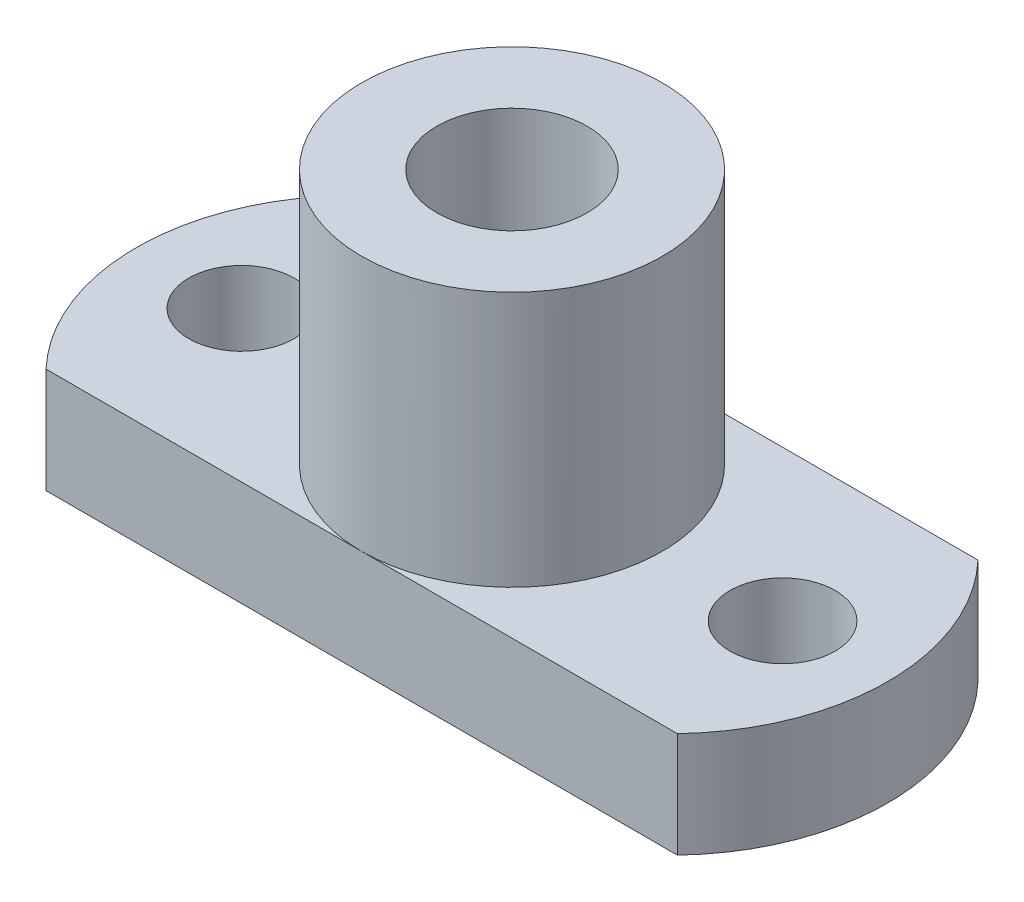
ISO-10303-21;
HEADER;
FILE_DESCRIPTION(('STEP AP214'),'2;1');
FILE_NAME('part.step','',(''),(''),'','','');
FILE_SCHEMA(('AUTOMOTIVE_DESIGN { 1 0 10303 214 1 1 1 1 }'));
ENDSEC;
DATA;
#1=APPLICATION_CONTEXT('core data for automotive mechanical design processes');
#2=APPLICATION_PROTOCOL_DEFINITION('international standard','automotive_design',2000,#1);
#3=PRODUCT_CONTEXT('',#1,'mechanical');
#4=PRODUCT('Part','Part','',(#3));
#5=PRODUCT_RELATED_PRODUCT_CATEGORY('part','',(#4));
#6=PRODUCT_DEFINITION_FORMATION('','',#4);
#7=PRODUCT_DEFINITION_CONTEXT('part definition',#1,'design');
#8=PRODUCT_DEFINITION('design','',#6,#7);
#9=PRODUCT_DEFINITION_SHAPE('','',#8);
#10=(LENGTH_UNIT() NAMED_UNIT(*) SI_UNIT(.MILLI.,.METRE.));
#11=(NAMED_UNIT(*) PLANE_ANGLE_UNIT() SI_UNIT($,.RADIAN.));
#12=(NAMED_UNIT(*) SI_UNIT($,.STERADIAN.) SOLID_ANGLE_UNIT());
#13=UNCERTAINTY_MEASURE_WITH_UNIT(LENGTH_MEASURE(1.E-05),#10,'distance_accuracy_value','');
#14=(GEOMETRIC_REPRESENTATION_CONTEXT(3) GLOBAL_UNCERTAINTY_ASSIGNED_CONTEXT((#13)) GLOBAL_UNIT_ASSIGNED_CONTEXT((#10,
#11,#12)) REPRESENTATION_CONTEXT('',''));
#15=CARTESIAN_POINT('',(0.,0.,0.));
#16=DIRECTION('',(0.,0.,1.));
#17=DIRECTION('',(1.,0.,0.));
#18=AXIS2_PLACEMENT_3D('',#15,#16,#17);
#19=CARTESIAN_POINT('',(0.,12.,0.));
#20=DIRECTION('',(0.,-1.,0.));
#21=DIRECTION('',(0.,0.,-1.));
#22=AXIS2_PLACEMENT_3D('',#19,#20,#21);
#23=CYLINDRICAL_SURFACE('',#22,5.);
#24=CARTESIAN_POINT('',(0.,12.,0.));
#25=DIRECTION('',(0.,1.,0.));
#26=DIRECTION('',(0.,0.,1.));
#27=AXIS2_PLACEMENT_3D('',#24,#25,#26);
#28=CIRCLE('',#27,5.);
#29=CARTESIAN_POINT('',(0.,12.,5.));
#30=VERTEX_POINT('',#29);
#31=EDGE_CURVE('E11',#30,#30,#28,.T.);
#32=ORIENTED_EDGE('',*,*,#31,.F.);
#33=EDGE_LOOP('',(#32));
#34=FACE_BOUND('',#33,.T.);
#35=CARTESIAN_POINT('',(0.,3.5,0.));
#36=DIRECTION('',(0.,-1.,0.));
#37=DIRECTION('',(0.,0.,1.));
#38=AXIS2_PLACEMENT_3D('',#35,#36,#37);
#39=CIRCLE('',#38,5.);
#40=CARTESIAN_POINT('',(0.,3.5,5.));
#41=VERTEX_POINT('',#40);
#42=CARTESIAN_POINT('',(0.,3.5,-5.));
#43=VERTEX_POINT('',#42);
#44=EDGE_CURVE('E92',#41,#43,#39,.T.);
#45=ORIENTED_EDGE('',*,*,#44,.F.);
#46=CARTESIAN_POINT('',(0.,3.5,0.));
#47=DIRECTION('',(0.,1.,0.));
#48=DIRECTION('',(0.,0.,1.));
#49=AXIS2_PLACEMENT_3D('',#46,#47,#48);
#50=CIRCLE('',#49,5.);
#51=EDGE_CURVE('E145',#41,#43,#50,.T.);
#52=ORIENTED_EDGE('',*,*,#51,.T.);
#53=EDGE_LOOP('',(#45,#52));
#54=FACE_BOUND('',#53,.T.);
#55=ADVANCED_FACE('F35',(#34,#54),#23,.T.);
#56=CARTESIAN_POINT('',(0.,12.,0.));
#57=DIRECTION('',(0.,1.,0.));
#58=DIRECTION('',(0.,0.,1.));
#59=AXIS2_PLACEMENT_3D('',#56,#57,#58);
#60=PLANE('',#59);
#61=ORIENTED_EDGE('',*,*,#31,.T.);
#62=EDGE_LOOP('',(#61));
#63=FACE_BOUND('',#62,.T.);
#64=CARTESIAN_POINT('',(0.,12.,0.));
#65=DIRECTION('',(0.,1.,0.));
#66=DIRECTION('',(0.,0.,1.));
#67=AXIS2_PLACEMENT_3D('',#64,#65,#66);
#68=CIRCLE('',#67,2.5);
#69=CARTESIAN_POINT('',(0.,12.,2.5));
#70=VERTEX_POINT('',#69);
#71=EDGE_CURVE('E43',#70,#70,#68,.T.);
#72=ORIENTED_EDGE('',*,*,#71,.F.);
#73=EDGE_LOOP('',(#72));
#74=FACE_BOUND('',#73,.T.);
#75=ADVANCED_FACE('F132',(#63,#74),#60,.T.);
#76=CARTESIAN_POINT('',(0.,0.,0.));
#77=DIRECTION('',(0.,1.,0.));
#78=DIRECTION('',(0.,0.,1.));
#79=AXIS2_PLACEMENT_3D('',#76,#77,#78);
#80=PLANE('',#79);
#81=DIRECTION('',(-1.,0.,0.));
#82=VECTOR('',#81,1.);
#83=CARTESIAN_POINT('',(-10.5,0.,-5.));
#84=LINE('',#83,#82);
#85=CARTESIAN_POINT('',(10.5,0.,-5.));
#86=VERTEX_POINT('',#85);
#87=CARTESIAN_POINT('',(-10.5,0.,-5.));
#88=VERTEX_POINT('',#87);
#89=EDGE_CURVE('E63',#86,#88,#84,.T.);
#90=ORIENTED_EDGE('',*,*,#89,.F.);
#91=CARTESIAN_POINT('',(5.25000000000001,0.,0.));
#92=DIRECTION('',(0.,-1.,0.));
#93=DIRECTION('',(0.,0.,-1.));
#94=AXIS2_PLACEMENT_3D('',#91,#92,#93);
#95=CIRCLE('',#94,7.25);
#96=CARTESIAN_POINT('',(10.5,0.,5.));
#97=VERTEX_POINT('',#96);
#98=EDGE_CURVE('E152',#86,#97,#95,.T.);
#99=ORIENTED_EDGE('',*,*,#98,.T.);
#100=DIRECTION('',(1.,0.,0.));
#101=VECTOR('',#100,1.);
#102=CARTESIAN_POINT('',(0.,0.,5.));
#103=LINE('',#102,#101);
#104=CARTESIAN_POINT('',(-10.5,0.,5.));
#105=VERTEX_POINT('',#104);
#106=EDGE_CURVE('E113',#105,#97,#103,.T.);
#107=ORIENTED_EDGE('',*,*,#106,.F.);
#108=CARTESIAN_POINT('',(-5.25000000000001,0.,0.));
#109=DIRECTION('',(0.,1.,0.));
#110=DIRECTION('',(0.,0.,-1.));
#111=AXIS2_PLACEMENT_3D('',#108,#109,#110);
#112=CIRCLE('',#111,7.25);
#113=EDGE_CURVE('E110',#88,#105,#112,.T.);
#114=ORIENTED_EDGE('',*,*,#113,.F.);
#115=EDGE_LOOP('',(#90,#99,#107,#114));
#116=FACE_BOUND('',#115,.T.);
#117=CARTESIAN_POINT('',(0.,0.,0.));
#118=DIRECTION('',(0.,1.,0.));
#119=DIRECTION('',(0.,0.,1.));
#120=AXIS2_PLACEMENT_3D('',#117,#118,#119);
#121=CIRCLE('',#120,2.5);
#122=CARTESIAN_POINT('',(0.,0.,2.5));
#123=VERTEX_POINT('',#122);
#124=EDGE_CURVE('E100',#123,#123,#121,.T.);
#125=ORIENTED_EDGE('',*,*,#124,.T.);
#126=EDGE_LOOP('',(#125));
#127=FACE_BOUND('',#126,.T.);
#128=CARTESIAN_POINT('',(-9.,0.,0.));
#129=DIRECTION('',(0.,1.,0.));
#130=DIRECTION('',(0.,0.,1.));
#131=AXIS2_PLACEMENT_3D('',#128,#129,#130);
#132=CIRCLE('',#131,1.75);
#133=CARTESIAN_POINT('',(-9.,0.,1.75));
#134=VERTEX_POINT('',#133);
#135=EDGE_CURVE('E169',#134,#134,#132,.T.);
#136=ORIENTED_EDGE('',*,*,#135,.T.);
#137=EDGE_LOOP('',(#136));
#138=FACE_BOUND('',#137,.T.);
#139=CARTESIAN_POINT('',(9.,0.,0.));
#140=DIRECTION('',(0.,-1.,0.));
#141=DIRECTION('',(0.,0.,1.));
#142=AXIS2_PLACEMENT_3D('',#139,#140,#141);
#143=CIRCLE('',#142,1.75);
#144=CARTESIAN_POINT('',(9.,0.,1.75));
#145=VERTEX_POINT('',#144);
#146=EDGE_CURVE('E237',#145,#145,#143,.T.);
#147=ORIENTED_EDGE('',*,*,#146,.F.);
#148=EDGE_LOOP('',(#147));
#149=FACE_BOUND('',#148,.T.);
#150=ADVANCED_FACE('F120',(#116,#127,#138,#149),#80,.F.);
#151=CARTESIAN_POINT('',(0.,12.,0.));
#152=DIRECTION('',(0.,-1.,0.));
#153=DIRECTION('',(0.,0.,-1.));
#154=AXIS2_PLACEMENT_3D('',#151,#152,#153);
#155=CYLINDRICAL_SURFACE('',#154,2.5);
#156=ORIENTED_EDGE('',*,*,#71,.T.);
#157=EDGE_LOOP('',(#156));
#158=FACE_BOUND('',#157,.T.);
#159=ORIENTED_EDGE('',*,*,#124,.F.);
#160=EDGE_LOOP('',(#159));
#161=FACE_BOUND('',#160,.T.);
#162=ADVANCED_FACE('F123',(#158,#161),#155,.F.);
#163=CARTESIAN_POINT('',(0.,3.5,0.));
#164=DIRECTION('',(0.,1.,0.));
#165=DIRECTION('',(0.,0.,1.));
#166=AXIS2_PLACEMENT_3D('',#163,#164,#165);
#167=PLANE('',#166);
#168=ORIENTED_EDGE('',*,*,#44,.T.);
#169=DIRECTION('',(-1.,0.,0.));
#170=VECTOR('',#169,1.);
#171=CARTESIAN_POINT('',(-10.5,3.5,-5.));
#172=LINE('',#171,#170);
#173=CARTESIAN_POINT('',(-10.5,3.5,-5.));
#174=VERTEX_POINT('',#173);
#175=EDGE_CURVE('E86',#43,#174,#172,.T.);
#176=ORIENTED_EDGE('',*,*,#175,.T.);
#177=CARTESIAN_POINT('',(-5.25000000000001,3.5,0.));
#178=DIRECTION('',(0.,1.,0.));
#179=DIRECTION('',(0.,0.,-1.));
#180=AXIS2_PLACEMENT_3D('',#177,#178,#179);
#181=CIRCLE('',#180,7.25);
#182=CARTESIAN_POINT('',(-10.5,3.5,5.));
#183=VERTEX_POINT('',#182);
#184=EDGE_CURVE('E90',#174,#183,#181,.T.);
#185=ORIENTED_EDGE('',*,*,#184,.T.);
#186=DIRECTION('',(1.,0.,0.));
#187=VECTOR('',#186,1.);
#188=CARTESIAN_POINT('',(0.,3.5,5.));
#189=LINE('',#188,#187);
#190=EDGE_CURVE('E51',#183,#41,#189,.T.);
#191=ORIENTED_EDGE('',*,*,#190,.T.);
#192=EDGE_LOOP('',(#168,#176,#185,#191));
#193=FACE_BOUND('',#192,.T.);
#194=CARTESIAN_POINT('',(-9.,3.5,0.));
#195=DIRECTION('',(0.,1.,0.));
#196=DIRECTION('',(0.,0.,1.));
#197=AXIS2_PLACEMENT_3D('',#194,#195,#196);
#198=CIRCLE('',#197,1.75);
#199=CARTESIAN_POINT('',(-9.,3.5,1.75));
#200=VERTEX_POINT('',#199);
#201=EDGE_CURVE('E111',#200,#200,#198,.T.);
#202=ORIENTED_EDGE('',*,*,#201,.F.);
#203=EDGE_LOOP('',(#202));
#204=FACE_BOUND('',#203,.T.);
#205=ADVANCED_FACE('F87',(#193,#204),#167,.T.);
#206=CARTESIAN_POINT('',(-10.5,3.5,-5.));
#207=DIRECTION('',(0.,0.,1.));
#208=DIRECTION('',(1.,0.,0.));
#209=AXIS2_PLACEMENT_3D('',#206,#207,#208);
#210=PLANE('',#209);
#211=ORIENTED_EDGE('',*,*,#89,.T.);
#212=DIRECTION('',(0.,-1.,0.));
#213=VECTOR('',#212,1.);
#214=CARTESIAN_POINT('',(-10.5,3.5,-5.));
#215=LINE('',#214,#213);
#216=EDGE_CURVE('E96',#174,#88,#215,.T.);
#217=ORIENTED_EDGE('',*,*,#216,.F.);
#218=ORIENTED_EDGE('',*,*,#175,.F.);
#219=DIRECTION('',(1.,0.,0.));
#220=VECTOR('',#219,1.);
#221=CARTESIAN_POINT('',(10.5,3.5,-5.));
#222=LINE('',#221,#220);
#223=CARTESIAN_POINT('',(10.5,3.5,-5.));
#224=VERTEX_POINT('',#223);
#225=EDGE_CURVE('E151',#43,#224,#222,.T.);
#226=ORIENTED_EDGE('',*,*,#225,.T.);
#227=DIRECTION('',(0.,-1.,0.));
#228=VECTOR('',#227,1.);
#229=CARTESIAN_POINT('',(10.5,3.5,-5.));
#230=LINE('',#229,#228);
#231=EDGE_CURVE('E73',#224,#86,#230,.T.);
#232=ORIENTED_EDGE('',*,*,#231,.T.);
#233=EDGE_LOOP('',(#211,#217,#218,#226,#232));
#234=FACE_BOUND('',#233,.T.);
#235=ADVANCED_FACE('F97',(#234),#210,.F.);
#236=CARTESIAN_POINT('',(-5.25000000000001,3.5,0.));
#237=DIRECTION('',(0.,-1.,0.));
#238=DIRECTION('',(0.,0.,-1.));
#239=AXIS2_PLACEMENT_3D('',#236,#237,#238);
#240=CYLINDRICAL_SURFACE('',#239,7.25);
#241=ORIENTED_EDGE('',*,*,#113,.T.);
#242=DIRECTION('',(0.,-1.,0.));
#243=VECTOR('',#242,1.);
#244=CARTESIAN_POINT('',(-10.5,3.5,5.));
#245=LINE('',#244,#243);
#246=EDGE_CURVE('E101',#183,#105,#245,.T.);
#247=ORIENTED_EDGE('',*,*,#246,.F.);
#248=ORIENTED_EDGE('',*,*,#184,.F.);
#249=ORIENTED_EDGE('',*,*,#216,.T.);
#250=EDGE_LOOP('',(#241,#247,#248,#249));
#251=FACE_BOUND('',#250,.T.);
#252=ADVANCED_FACE('F103',(#251),#240,.T.);
#253=CARTESIAN_POINT('',(0.,3.5,5.));
#254=DIRECTION('',(0.,0.,-1.));
#255=DIRECTION('',(-1.,0.,0.));
#256=AXIS2_PLACEMENT_3D('',#253,#254,#255);
#257=PLANE('',#256);
#258=ORIENTED_EDGE('',*,*,#106,.T.);
#259=DIRECTION('',(0.,-1.,0.));
#260=VECTOR('',#259,1.);
#261=CARTESIAN_POINT('',(10.5,3.5,5.));
#262=LINE('',#261,#260);
#263=CARTESIAN_POINT('',(10.5,3.5,5.));
#264=VERTEX_POINT('',#263);
#265=EDGE_CURVE('E157',#264,#97,#262,.T.);
#266=ORIENTED_EDGE('',*,*,#265,.F.);
#267=DIRECTION('',(-1.,0.,0.));
#268=VECTOR('',#267,1.);
#269=CARTESIAN_POINT('',(0.,3.5,5.));
#270=LINE('',#269,#268);
#271=EDGE_CURVE('E150',#264,#41,#270,.T.);
#272=ORIENTED_EDGE('',*,*,#271,.T.);
#273=ORIENTED_EDGE('',*,*,#190,.F.);
#274=ORIENTED_EDGE('',*,*,#246,.T.);
#275=EDGE_LOOP('',(#258,#266,#272,#273,#274));
#276=FACE_BOUND('',#275,.T.);
#277=ADVANCED_FACE('F155',(#276),#257,.F.);
#278=CARTESIAN_POINT('',(-9.,3.5,0.));
#279=DIRECTION('',(0.,-1.,0.));
#280=DIRECTION('',(0.,0.,-1.));
#281=AXIS2_PLACEMENT_3D('',#278,#279,#280);
#282=CYLINDRICAL_SURFACE('',#281,1.75);
#283=ORIENTED_EDGE('',*,*,#201,.T.);
#284=EDGE_LOOP('',(#283));
#285=FACE_BOUND('',#284,.T.);
#286=ORIENTED_EDGE('',*,*,#135,.F.);
#287=EDGE_LOOP('',(#286));
#288=FACE_BOUND('',#287,.T.);
#289=ADVANCED_FACE('F176',(#285,#288),#282,.F.);
#290=CARTESIAN_POINT('',(5.25000000000001,3.5,0.));
#291=DIRECTION('',(0.,-1.,0.));
#292=DIRECTION('',(0.,0.,-1.));
#293=AXIS2_PLACEMENT_3D('',#290,#291,#292);
#294=CYLINDRICAL_SURFACE('',#293,7.25);
#295=ORIENTED_EDGE('',*,*,#98,.F.);
#296=ORIENTED_EDGE('',*,*,#231,.F.);
#297=CARTESIAN_POINT('',(5.25000000000001,3.5,0.));
#298=DIRECTION('',(0.,-1.,0.));
#299=DIRECTION('',(0.,0.,-1.));
#300=AXIS2_PLACEMENT_3D('',#297,#298,#299);
#301=CIRCLE('',#300,7.25);
#302=EDGE_CURVE('E158',#224,#264,#301,.T.);
#303=ORIENTED_EDGE('',*,*,#302,.T.);
#304=ORIENTED_EDGE('',*,*,#265,.T.);
#305=EDGE_LOOP('',(#295,#296,#303,#304));
#306=FACE_BOUND('',#305,.T.);
#307=ADVANCED_FACE('F178',(#306),#294,.T.);
#308=CARTESIAN_POINT('',(0.,3.5,0.));
#309=DIRECTION('',(0.,1.,0.));
#310=DIRECTION('',(0.,0.,1.));
#311=AXIS2_PLACEMENT_3D('',#308,#309,#310);
#312=PLANE('',#311);
#313=CARTESIAN_POINT('',(9.,3.5,0.));
#314=DIRECTION('',(0.,-1.,0.));
#315=DIRECTION('',(0.,0.,1.));
#316=AXIS2_PLACEMENT_3D('',#313,#314,#315);
#317=CIRCLE('',#316,1.75);
#318=CARTESIAN_POINT('',(9.,3.5,1.75));
#319=VERTEX_POINT('',#318);
#320=EDGE_CURVE('E166',#319,#319,#317,.T.);
#321=ORIENTED_EDGE('',*,*,#320,.T.);
#322=EDGE_LOOP('',(#321));
#323=FACE_BOUND('',#322,.T.);
#324=ORIENTED_EDGE('',*,*,#51,.F.);
#325=ORIENTED_EDGE('',*,*,#271,.F.);
#326=ORIENTED_EDGE('',*,*,#302,.F.);
#327=ORIENTED_EDGE('',*,*,#225,.F.);
#328=EDGE_LOOP('',(#324,#325,#326,#327));
#329=FACE_BOUND('',#328,.T.);
#330=ADVANCED_FACE('F149',(#323,#329),#312,.T.);
#331=CARTESIAN_POINT('',(9.,3.5,0.));
#332=DIRECTION('',(0.,-1.,0.));
#333=DIRECTION('',(0.,0.,-1.));
#334=AXIS2_PLACEMENT_3D('',#331,#332,#333);
#335=CYLINDRICAL_SURFACE('',#334,1.75);
#336=ORIENTED_EDGE('',*,*,#320,.F.);
#337=EDGE_LOOP('',(#336));
#338=FACE_BOUND('',#337,.T.);
#339=ORIENTED_EDGE('',*,*,#146,.T.);
#340=EDGE_LOOP('',(#339));
#341=FACE_BOUND('',#340,.T.);
#342=ADVANCED_FACE('F219',(#338,#341),#335,.F.);
#343=CLOSED_SHELL('',(#55,#75,#150,#162,#205,#235,#252,#277,#289,#307,#330,#342));
#344=MANIFOLD_SOLID_BREP('B2',#343);
#345=ADVANCED_BREP_SHAPE_REPRESENTATION('',(#18,#344),#14);
#346=SHAPE_DEFINITION_REPRESENTATION(#9,#345);
ENDSEC;
END-ISO-10303-21;
